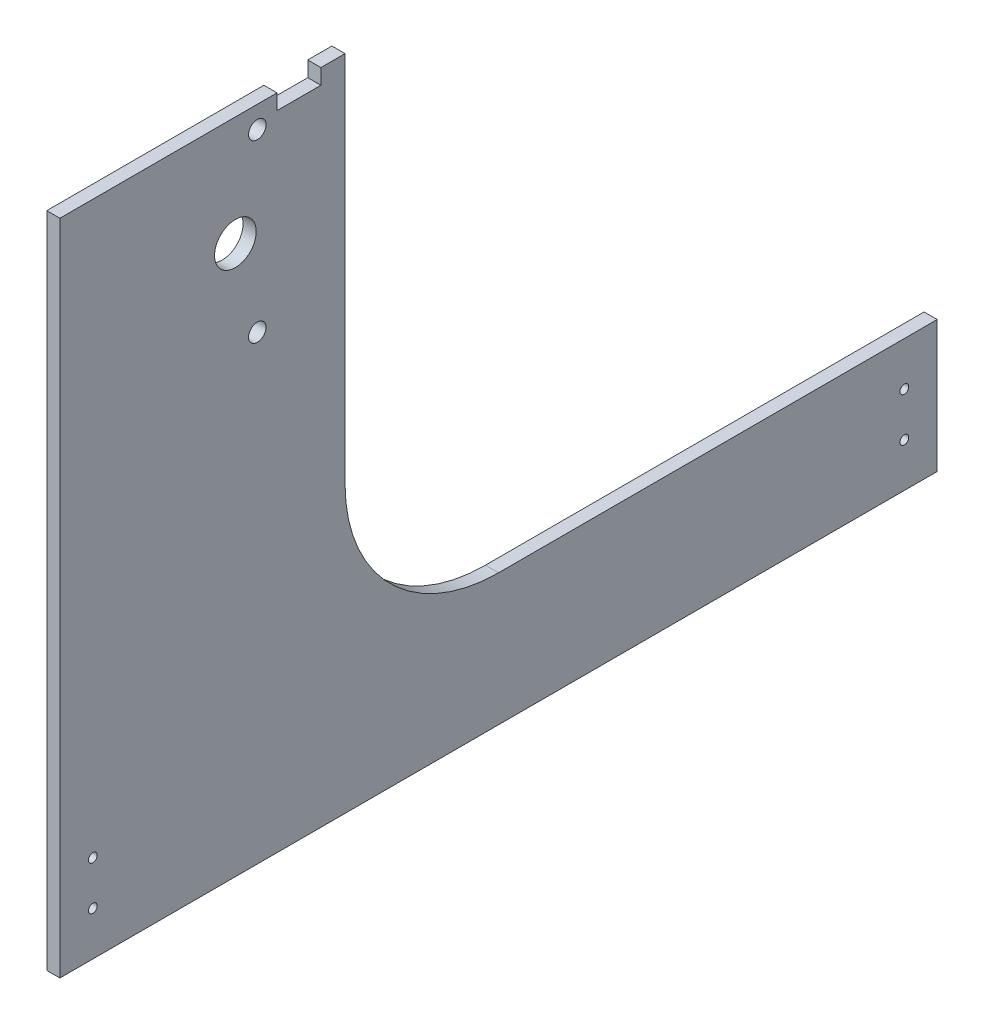
ISO-10303-21;
HEADER;
FILE_DESCRIPTION(('STEP AP214'),'2;1');
FILE_NAME('part.step','',(''),(''),'','','');
FILE_SCHEMA(('AUTOMOTIVE_DESIGN { 1 0 10303 214 1 1 1 1 }'));
ENDSEC;
DATA;
#1=APPLICATION_CONTEXT('core data for automotive mechanical design processes');
#2=APPLICATION_PROTOCOL_DEFINITION('international standard','automotive_design',2000,#1);
#3=PRODUCT_CONTEXT('',#1,'mechanical');
#4=PRODUCT('Part','Part','',(#3));
#5=PRODUCT_RELATED_PRODUCT_CATEGORY('part','',(#4));
#6=PRODUCT_DEFINITION_FORMATION('','',#4);
#7=PRODUCT_DEFINITION_CONTEXT('part definition',#1,'design');
#8=PRODUCT_DEFINITION('design','',#6,#7);
#9=PRODUCT_DEFINITION_SHAPE('','',#8);
#10=(LENGTH_UNIT() NAMED_UNIT(*) SI_UNIT(.MILLI.,.METRE.));
#11=(NAMED_UNIT(*) PLANE_ANGLE_UNIT() SI_UNIT($,.RADIAN.));
#12=(NAMED_UNIT(*) SI_UNIT($,.STERADIAN.) SOLID_ANGLE_UNIT());
#13=UNCERTAINTY_MEASURE_WITH_UNIT(LENGTH_MEASURE(1.E-05),#10,'distance_accuracy_value','');
#14=(GEOMETRIC_REPRESENTATION_CONTEXT(3) GLOBAL_UNCERTAINTY_ASSIGNED_CONTEXT((#13)) GLOBAL_UNIT_ASSIGNED_CONTEXT((#10,
#11,#12)) REPRESENTATION_CONTEXT('',''));
#15=CARTESIAN_POINT('',(0.,0.,0.));
#16=DIRECTION('',(0.,0.,1.));
#17=DIRECTION('',(1.,0.,0.));
#18=AXIS2_PLACEMENT_3D('',#15,#16,#17);
#19=CARTESIAN_POINT('',(6.,0.,80.));
#20=DIRECTION('',(0.,0.,-1.));
#21=DIRECTION('',(0.,1.,0.));
#22=AXIS2_PLACEMENT_3D('',#19,#20,#21);
#23=PLANE('',#22);
#24=DIRECTION('',(0.,-1.,0.));
#25=VECTOR('',#24,1.);
#26=CARTESIAN_POINT('',(0.,0.,80.));
#27=LINE('',#26,#25);
#28=CARTESIAN_POINT('',(0.,50.0000000000005,80.));
#29=VERTEX_POINT('',#28);
#30=CARTESIAN_POINT('',(0.,-250.,80.));
#31=VERTEX_POINT('',#30);
#32=EDGE_CURVE('E155',#29,#31,#27,.T.);
#33=ORIENTED_EDGE('',*,*,#32,.T.);
#34=DIRECTION('',(-1.,0.,0.));
#35=VECTOR('',#34,1.);
#36=CARTESIAN_POINT('',(6.,-250.,80.));
#37=LINE('',#36,#35);
#38=CARTESIAN_POINT('',(6.,-250.,80.));
#39=VERTEX_POINT('',#38);
#40=EDGE_CURVE('E11',#39,#31,#37,.T.);
#41=ORIENTED_EDGE('',*,*,#40,.F.);
#42=DIRECTION('',(0.,-1.,0.));
#43=VECTOR('',#42,1.);
#44=CARTESIAN_POINT('',(6.,0.,80.));
#45=LINE('',#44,#43);
#46=CARTESIAN_POINT('',(6.,50.0000000000005,80.));
#47=VERTEX_POINT('',#46);
#48=EDGE_CURVE('E98',#47,#39,#45,.T.);
#49=ORIENTED_EDGE('',*,*,#48,.F.);
#50=DIRECTION('',(-1.,0.,0.));
#51=VECTOR('',#50,1.);
#52=CARTESIAN_POINT('',(6.,50.0000000000005,80.));
#53=LINE('',#52,#51);
#54=EDGE_CURVE('E235',#47,#29,#53,.T.);
#55=ORIENTED_EDGE('',*,*,#54,.T.);
#56=EDGE_LOOP('',(#33,#41,#49,#55));
#57=FACE_BOUND('',#56,.T.);
#58=ADVANCED_FACE('F35',(#57),#23,.F.);
#59=CARTESIAN_POINT('',(6.,-250.,0.));
#60=DIRECTION('',(0.,1.,0.));
#61=DIRECTION('',(0.,0.,1.));
#62=AXIS2_PLACEMENT_3D('',#59,#60,#61);
#63=PLANE('',#62);
#64=DIRECTION('',(-1.,0.,0.));
#65=VECTOR('',#64,1.);
#66=CARTESIAN_POINT('',(6.,-250.,-320.));
#67=LINE('',#66,#65);
#68=CARTESIAN_POINT('',(6.,-250.,-320.));
#69=VERTEX_POINT('',#68);
#70=CARTESIAN_POINT('',(0.,-250.,-320.));
#71=VERTEX_POINT('',#70);
#72=EDGE_CURVE('E43',#69,#71,#67,.T.);
#73=ORIENTED_EDGE('',*,*,#72,.F.);
#74=DIRECTION('',(0.,0.,-1.));
#75=VECTOR('',#74,1.);
#76=CARTESIAN_POINT('',(6.,-250.,0.));
#77=LINE('',#76,#75);
#78=EDGE_CURVE('E221',#39,#69,#77,.T.);
#79=ORIENTED_EDGE('',*,*,#78,.F.);
#80=ORIENTED_EDGE('',*,*,#40,.T.);
#81=DIRECTION('',(0.,0.,-1.));
#82=VECTOR('',#81,1.);
#83=CARTESIAN_POINT('',(0.,-250.,0.));
#84=LINE('',#83,#82);
#85=EDGE_CURVE('E157',#31,#71,#84,.T.);
#86=ORIENTED_EDGE('',*,*,#85,.T.);
#87=EDGE_LOOP('',(#73,#79,#80,#86));
#88=FACE_BOUND('',#87,.T.);
#89=ADVANCED_FACE('F270',(#88),#63,.F.);
#90=CARTESIAN_POINT('',(6.,0.,-320.));
#91=DIRECTION('',(0.,0.,-1.));
#92=DIRECTION('',(-1.,0.,0.));
#93=AXIS2_PLACEMENT_3D('',#90,#91,#92);
#94=PLANE('',#93);
#95=DIRECTION('',(0.,-1.,0.));
#96=VECTOR('',#95,1.);
#97=CARTESIAN_POINT('',(0.,0.,-320.));
#98=LINE('',#97,#96);
#99=CARTESIAN_POINT('',(0.,-190.,-320.));
#100=VERTEX_POINT('',#99);
#101=EDGE_CURVE('E160',#100,#71,#98,.T.);
#102=ORIENTED_EDGE('',*,*,#101,.F.);
#103=DIRECTION('',(-1.,0.,0.));
#104=VECTOR('',#103,1.);
#105=CARTESIAN_POINT('',(6.,-190.,-320.));
#106=LINE('',#105,#104);
#107=CARTESIAN_POINT('',(6.,-190.,-320.));
#108=VERTEX_POINT('',#107);
#109=EDGE_CURVE('E197',#108,#100,#106,.T.);
#110=ORIENTED_EDGE('',*,*,#109,.F.);
#111=DIRECTION('',(0.,-1.,0.));
#112=VECTOR('',#111,1.);
#113=CARTESIAN_POINT('',(6.,0.,-320.));
#114=LINE('',#113,#112);
#115=EDGE_CURVE('E205',#108,#69,#114,.T.);
#116=ORIENTED_EDGE('',*,*,#115,.T.);
#117=ORIENTED_EDGE('',*,*,#72,.T.);
#118=EDGE_LOOP('',(#102,#110,#116,#117));
#119=FACE_BOUND('',#118,.T.);
#120=ADVANCED_FACE('F203',(#119),#94,.T.);
#121=CARTESIAN_POINT('',(6.,-190.,0.));
#122=DIRECTION('',(0.,1.,0.));
#123=DIRECTION('',(0.,0.,1.));
#124=AXIS2_PLACEMENT_3D('',#121,#122,#123);
#125=PLANE('',#124);
#126=DIRECTION('',(0.,0.,-1.));
#127=VECTOR('',#126,1.);
#128=CARTESIAN_POINT('',(0.,-190.,0.));
#129=LINE('',#128,#127);
#130=CARTESIAN_POINT('',(0.,-190.,-120.));
#131=VERTEX_POINT('',#130);
#132=EDGE_CURVE('E163',#131,#100,#129,.T.);
#133=ORIENTED_EDGE('',*,*,#132,.F.);
#134=DIRECTION('',(-1.,0.,0.));
#135=VECTOR('',#134,1.);
#136=CARTESIAN_POINT('',(6.,-190.,-120.));
#137=LINE('',#136,#135);
#138=CARTESIAN_POINT('',(6.,-190.,-120.));
#139=VERTEX_POINT('',#138);
#140=EDGE_CURVE('E195',#139,#131,#137,.T.);
#141=ORIENTED_EDGE('',*,*,#140,.F.);
#142=DIRECTION('',(0.,0.,-1.));
#143=VECTOR('',#142,1.);
#144=CARTESIAN_POINT('',(6.,-190.,0.));
#145=LINE('',#144,#143);
#146=EDGE_CURVE('E220',#139,#108,#145,.T.);
#147=ORIENTED_EDGE('',*,*,#146,.T.);
#148=ORIENTED_EDGE('',*,*,#109,.T.);
#149=EDGE_LOOP('',(#133,#141,#147,#148));
#150=FACE_BOUND('',#149,.T.);
#151=ADVANCED_FACE('F216',(#150),#125,.T.);
#152=CARTESIAN_POINT('',(6.,-120.,-120.));
#153=DIRECTION('',(-1.,0.,0.));
#154=DIRECTION('',(0.,0.,1.));
#155=AXIS2_PLACEMENT_3D('',#152,#153,#154);
#156=CYLINDRICAL_SURFACE('',#155,70.);
#157=CARTESIAN_POINT('',(0.,-120.,-120.));
#158=DIRECTION('',(1.,0.,0.));
#159=DIRECTION('',(0.,0.,-1.));
#160=AXIS2_PLACEMENT_3D('',#157,#158,#159);
#161=CIRCLE('',#160,70.);
#162=CARTESIAN_POINT('',(0.,-120.,-50.));
#163=VERTEX_POINT('',#162);
#164=EDGE_CURVE('E166',#131,#163,#161,.F.);
#165=ORIENTED_EDGE('',*,*,#164,.T.);
#166=DIRECTION('',(-1.,0.,0.));
#167=VECTOR('',#166,1.);
#168=CARTESIAN_POINT('',(6.,-120.,-50.));
#169=LINE('',#168,#167);
#170=CARTESIAN_POINT('',(6.,-120.,-50.));
#171=VERTEX_POINT('',#170);
#172=EDGE_CURVE('E193',#171,#163,#169,.T.);
#173=ORIENTED_EDGE('',*,*,#172,.F.);
#174=CARTESIAN_POINT('',(6.,-120.,-120.));
#175=DIRECTION('',(1.,0.,0.));
#176=DIRECTION('',(0.,0.,-1.));
#177=AXIS2_PLACEMENT_3D('',#174,#175,#176);
#178=CIRCLE('',#177,70.);
#179=EDGE_CURVE('E223',#139,#171,#178,.F.);
#180=ORIENTED_EDGE('',*,*,#179,.F.);
#181=ORIENTED_EDGE('',*,*,#140,.T.);
#182=EDGE_LOOP('',(#165,#173,#180,#181));
#183=FACE_BOUND('',#182,.T.);
#184=ADVANCED_FACE('F281',(#183),#156,.F.);
#185=CARTESIAN_POINT('',(6.,0.,-50.));
#186=DIRECTION('',(0.,0.,-1.));
#187=DIRECTION('',(0.,1.,0.));
#188=AXIS2_PLACEMENT_3D('',#185,#186,#187);
#189=PLANE('',#188);
#190=DIRECTION('',(0.,-1.,0.));
#191=VECTOR('',#190,1.);
#192=CARTESIAN_POINT('',(0.,0.,-50.));
#193=LINE('',#192,#191);
#194=CARTESIAN_POINT('',(0.,50.0000000000004,-50.));
#195=VERTEX_POINT('',#194);
#196=EDGE_CURVE('E169',#195,#163,#193,.T.);
#197=ORIENTED_EDGE('',*,*,#196,.F.);
#198=DIRECTION('',(-1.,0.,0.));
#199=VECTOR('',#198,1.);
#200=CARTESIAN_POINT('',(6.,50.0000000000004,-50.));
#201=LINE('',#200,#199);
#202=CARTESIAN_POINT('',(6.,50.0000000000004,-50.));
#203=VERTEX_POINT('',#202);
#204=EDGE_CURVE('E191',#203,#195,#201,.T.);
#205=ORIENTED_EDGE('',*,*,#204,.F.);
#206=DIRECTION('',(0.,-1.,0.));
#207=VECTOR('',#206,1.);
#208=CARTESIAN_POINT('',(6.,0.,-50.));
#209=LINE('',#208,#207);
#210=EDGE_CURVE('E229',#203,#171,#209,.T.);
#211=ORIENTED_EDGE('',*,*,#210,.T.);
#212=ORIENTED_EDGE('',*,*,#172,.T.);
#213=EDGE_LOOP('',(#197,#205,#211,#212));
#214=FACE_BOUND('',#213,.T.);
#215=ADVANCED_FACE('F284',(#214),#189,.T.);
#216=CARTESIAN_POINT('',(6.,50.0000000000005,0.));
#217=DIRECTION('',(0.,1.,0.));
#218=DIRECTION('',(0.,0.,1.));
#219=AXIS2_PLACEMENT_3D('',#216,#217,#218);
#220=PLANE('',#219);
#221=DIRECTION('',(0.,0.,-1.));
#222=VECTOR('',#221,1.);
#223=CARTESIAN_POINT('',(0.,50.0000000000005,0.));
#224=LINE('',#223,#222);
#225=CARTESIAN_POINT('',(0.,50.0000000000004,-39.0000000000001));
#226=VERTEX_POINT('',#225);
#227=EDGE_CURVE('E172',#226,#195,#224,.T.);
#228=ORIENTED_EDGE('',*,*,#227,.F.);
#229=DIRECTION('',(-1.,0.,0.));
#230=VECTOR('',#229,1.);
#231=CARTESIAN_POINT('',(6.,50.0000000000004,-39.0000000000001));
#232=LINE('',#231,#230);
#233=CARTESIAN_POINT('',(6.,50.0000000000004,-39.0000000000001));
#234=VERTEX_POINT('',#233);
#235=EDGE_CURVE('E140',#234,#226,#232,.T.);
#236=ORIENTED_EDGE('',*,*,#235,.F.);
#237=DIRECTION('',(0.,0.,-1.));
#238=VECTOR('',#237,1.);
#239=CARTESIAN_POINT('',(6.,50.0000000000005,0.));
#240=LINE('',#239,#238);
#241=EDGE_CURVE('E130',#234,#203,#240,.T.);
#242=ORIENTED_EDGE('',*,*,#241,.T.);
#243=ORIENTED_EDGE('',*,*,#204,.T.);
#244=EDGE_LOOP('',(#228,#236,#242,#243));
#245=FACE_BOUND('',#244,.T.);
#246=ADVANCED_FACE('F288',(#245),#220,.T.);
#247=CARTESIAN_POINT('',(6.,0.,-39.0000000000001));
#248=DIRECTION('',(0.,0.,-1.));
#249=DIRECTION('',(-1.,0.,0.));
#250=AXIS2_PLACEMENT_3D('',#247,#248,#249);
#251=PLANE('',#250);
#252=DIRECTION('',(0.,-1.,0.));
#253=VECTOR('',#252,1.);
#254=CARTESIAN_POINT('',(0.,0.,-39.0000000000001));
#255=LINE('',#254,#253);
#256=CARTESIAN_POINT('',(0.,43.0000000000004,-39.0000000000001));
#257=VERTEX_POINT('',#256);
#258=EDGE_CURVE('E137',#226,#257,#255,.T.);
#259=ORIENTED_EDGE('',*,*,#258,.T.);
#260=DIRECTION('',(-1.,0.,0.));
#261=VECTOR('',#260,1.);
#262=CARTESIAN_POINT('',(6.,43.0000000000004,-39.0000000000001));
#263=LINE('',#262,#261);
#264=CARTESIAN_POINT('',(6.,43.0000000000004,-39.0000000000001));
#265=VERTEX_POINT('',#264);
#266=EDGE_CURVE('E134',#265,#257,#263,.T.);
#267=ORIENTED_EDGE('',*,*,#266,.F.);
#268=DIRECTION('',(0.,-1.,0.));
#269=VECTOR('',#268,1.);
#270=CARTESIAN_POINT('',(6.,0.,-39.0000000000001));
#271=LINE('',#270,#269);
#272=EDGE_CURVE('E122',#234,#265,#271,.T.);
#273=ORIENTED_EDGE('',*,*,#272,.F.);
#274=ORIENTED_EDGE('',*,*,#235,.T.);
#275=EDGE_LOOP('',(#259,#267,#273,#274));
#276=FACE_BOUND('',#275,.T.);
#277=ADVANCED_FACE('F135',(#276),#251,.F.);
#278=CARTESIAN_POINT('',(6.,43.0000000000004,0.));
#279=DIRECTION('',(0.,-1.,0.));
#280=DIRECTION('',(0.,0.,-1.));
#281=AXIS2_PLACEMENT_3D('',#278,#279,#280);
#282=PLANE('',#281);
#283=DIRECTION('',(0.,0.,1.));
#284=VECTOR('',#283,1.);
#285=CARTESIAN_POINT('',(0.,43.0000000000004,0.));
#286=LINE('',#285,#284);
#287=CARTESIAN_POINT('',(0.,43.0000000000004,-19.0000000000001));
#288=VERTEX_POINT('',#287);
#289=EDGE_CURVE('E177',#257,#288,#286,.T.);
#290=ORIENTED_EDGE('',*,*,#289,.T.);
#291=DIRECTION('',(-1.,0.,0.));
#292=VECTOR('',#291,1.);
#293=CARTESIAN_POINT('',(6.,43.0000000000004,-19.0000000000001));
#294=LINE('',#293,#292);
#295=CARTESIAN_POINT('',(6.,43.0000000000004,-19.0000000000001));
#296=VERTEX_POINT('',#295);
#297=EDGE_CURVE('E85',#296,#288,#294,.T.);
#298=ORIENTED_EDGE('',*,*,#297,.F.);
#299=DIRECTION('',(0.,0.,1.));
#300=VECTOR('',#299,1.);
#301=CARTESIAN_POINT('',(6.,43.0000000000004,0.));
#302=LINE('',#301,#300);
#303=EDGE_CURVE('E127',#265,#296,#302,.T.);
#304=ORIENTED_EDGE('',*,*,#303,.F.);
#305=ORIENTED_EDGE('',*,*,#266,.T.);
#306=EDGE_LOOP('',(#290,#298,#304,#305));
#307=FACE_BOUND('',#306,.T.);
#308=ADVANCED_FACE('F142',(#307),#282,.F.);
#309=CARTESIAN_POINT('',(6.,0.,-19.0000000000001));
#310=DIRECTION('',(0.,0.,-1.));
#311=DIRECTION('',(-1.,0.,0.));
#312=AXIS2_PLACEMENT_3D('',#309,#310,#311);
#313=PLANE('',#312);
#314=DIRECTION('',(0.,-1.,0.));
#315=VECTOR('',#314,1.);
#316=CARTESIAN_POINT('',(0.,0.,-19.0000000000001));
#317=LINE('',#316,#315);
#318=CARTESIAN_POINT('',(0.,50.0000000000004,-19.0000000000001));
#319=VERTEX_POINT('',#318);
#320=EDGE_CURVE('E179',#319,#288,#317,.T.);
#321=ORIENTED_EDGE('',*,*,#320,.F.);
#322=DIRECTION('',(-1.,0.,0.));
#323=VECTOR('',#322,1.);
#324=CARTESIAN_POINT('',(6.,50.0000000000004,-19.0000000000001));
#325=LINE('',#324,#323);
#326=CARTESIAN_POINT('',(6.,50.0000000000004,-19.0000000000001));
#327=VERTEX_POINT('',#326);
#328=EDGE_CURVE('E51',#327,#319,#325,.T.);
#329=ORIENTED_EDGE('',*,*,#328,.F.);
#330=DIRECTION('',(0.,-1.,0.));
#331=VECTOR('',#330,1.);
#332=CARTESIAN_POINT('',(6.,0.,-19.0000000000001));
#333=LINE('',#332,#331);
#334=EDGE_CURVE('E143',#327,#296,#333,.T.);
#335=ORIENTED_EDGE('',*,*,#334,.T.);
#336=ORIENTED_EDGE('',*,*,#297,.T.);
#337=EDGE_LOOP('',(#321,#329,#335,#336));
#338=FACE_BOUND('',#337,.T.);
#339=ADVANCED_FACE('F294',(#338),#313,.T.);
#340=EDGE_CURVE('E175',#29,#319,#224,.T.);
#341=ORIENTED_EDGE('',*,*,#340,.F.);
#342=ORIENTED_EDGE('',*,*,#54,.F.);
#343=EDGE_CURVE('E145',#47,#327,#240,.T.);
#344=ORIENTED_EDGE('',*,*,#343,.T.);
#345=ORIENTED_EDGE('',*,*,#328,.T.);
#346=EDGE_LOOP('',(#341,#342,#344,#345));
#347=FACE_BOUND('',#346,.T.);
#348=ADVANCED_FACE('F233',(#347),#220,.T.);
#349=CARTESIAN_POINT('',(6.,-39.9999999999996,-10.0000000000001));
#350=DIRECTION('',(-1.,0.,0.));
#351=DIRECTION('',(0.,0.,1.));
#352=AXIS2_PLACEMENT_3D('',#349,#350,#351);
#353=CYLINDRICAL_SURFACE('',#352,4.);
#354=CARTESIAN_POINT('',(6.,-39.9999999999996,-10.0000000000001));
#355=DIRECTION('',(1.,0.,0.));
#356=DIRECTION('',(0.,0.,-1.));
#357=AXIS2_PLACEMENT_3D('',#354,#355,#356);
#358=CIRCLE('',#357,4.);
#359=CARTESIAN_POINT('',(6.,-39.9999999999996,-14.0000000000001));
#360=VERTEX_POINT('',#359);
#361=EDGE_CURVE('E152',#360,#360,#358,.T.);
#362=ORIENTED_EDGE('',*,*,#361,.T.);
#363=EDGE_LOOP('',(#362));
#364=FACE_BOUND('',#363,.T.);
#365=CARTESIAN_POINT('',(0.,-39.9999999999996,-10.0000000000001));
#366=DIRECTION('',(1.,0.,0.));
#367=DIRECTION('',(0.,0.,-1.));
#368=AXIS2_PLACEMENT_3D('',#365,#366,#367);
#369=CIRCLE('',#368,4.);
#370=CARTESIAN_POINT('',(0.,-39.9999999999996,-14.0000000000001));
#371=VERTEX_POINT('',#370);
#372=EDGE_CURVE('E185',#371,#371,#369,.T.);
#373=ORIENTED_EDGE('',*,*,#372,.F.);
#374=EDGE_LOOP('',(#373));
#375=FACE_BOUND('',#374,.T.);
#376=ADVANCED_FACE('F299',(#364,#375),#353,.F.);
#377=CARTESIAN_POINT('',(6.,40.0000000000004,-10.0000000000001));
#378=DIRECTION('',(-1.,0.,0.));
#379=DIRECTION('',(0.,0.,1.));
#380=AXIS2_PLACEMENT_3D('',#377,#378,#379);
#381=CYLINDRICAL_SURFACE('',#380,4.);
#382=CARTESIAN_POINT('',(6.,40.0000000000004,-10.0000000000001));
#383=DIRECTION('',(1.,0.,0.));
#384=DIRECTION('',(0.,0.,-1.));
#385=AXIS2_PLACEMENT_3D('',#382,#383,#384);
#386=CIRCLE('',#385,4.);
#387=CARTESIAN_POINT('',(6.,40.0000000000004,-14.0000000000001));
#388=VERTEX_POINT('',#387);
#389=EDGE_CURVE('E149',#388,#388,#386,.T.);
#390=ORIENTED_EDGE('',*,*,#389,.T.);
#391=EDGE_LOOP('',(#390));
#392=FACE_BOUND('',#391,.T.);
#393=CARTESIAN_POINT('',(0.,40.0000000000004,-10.0000000000001));
#394=DIRECTION('',(1.,0.,0.));
#395=DIRECTION('',(0.,0.,-1.));
#396=AXIS2_PLACEMENT_3D('',#393,#394,#395);
#397=CIRCLE('',#396,4.);
#398=CARTESIAN_POINT('',(0.,40.0000000000004,-14.0000000000001));
#399=VERTEX_POINT('',#398);
#400=EDGE_CURVE('E182',#399,#399,#397,.T.);
#401=ORIENTED_EDGE('',*,*,#400,.F.);
#402=EDGE_LOOP('',(#401));
#403=FACE_BOUND('',#402,.T.);
#404=ADVANCED_FACE('F263',(#392,#403),#381,.F.);
#405=CARTESIAN_POINT('',(6.,0.,0.));
#406=DIRECTION('',(1.,0.,0.));
#407=DIRECTION('',(0.,0.,-1.));
#408=AXIS2_PLACEMENT_3D('',#405,#406,#407);
#409=PLANE('',#408);
#410=CARTESIAN_POINT('',(6.,-209.99999999998,-305.));
#411=DIRECTION('',(1.,0.,0.));
#412=DIRECTION('',(0.,0.,-1.));
#413=AXIS2_PLACEMENT_3D('',#410,#411,#412);
#414=CIRCLE('',#413,2.);
#415=CARTESIAN_POINT('',(6.,-209.99999999998,-307.));
#416=VERTEX_POINT('',#415);
#417=EDGE_CURVE('E377',#416,#416,#414,.F.);
#418=ORIENTED_EDGE('',*,*,#417,.T.);
#419=EDGE_LOOP('',(#418));
#420=FACE_BOUND('',#419,.T.);
#421=CARTESIAN_POINT('',(6.,-230.000000000025,-305.));
#422=DIRECTION('',(1.,0.,0.));
#423=DIRECTION('',(0.,0.,-1.));
#424=AXIS2_PLACEMENT_3D('',#421,#422,#423);
#425=CIRCLE('',#424,2.);
#426=CARTESIAN_POINT('',(6.,-230.000000000025,-307.));
#427=VERTEX_POINT('',#426);
#428=EDGE_CURVE('E380',#427,#427,#425,.F.);
#429=ORIENTED_EDGE('',*,*,#428,.T.);
#430=EDGE_LOOP('',(#429));
#431=FACE_BOUND('',#430,.T.);
#432=CARTESIAN_POINT('',(6.,-230.000000000024,64.9999999999999));
#433=DIRECTION('',(1.,0.,0.));
#434=DIRECTION('',(0.,0.,-1.));
#435=AXIS2_PLACEMENT_3D('',#432,#433,#434);
#436=CIRCLE('',#435,2.);
#437=CARTESIAN_POINT('',(6.,-230.000000000024,62.9999999999999));
#438=VERTEX_POINT('',#437);
#439=EDGE_CURVE('E389',#438,#438,#436,.F.);
#440=ORIENTED_EDGE('',*,*,#439,.T.);
#441=EDGE_LOOP('',(#440));
#442=FACE_BOUND('',#441,.T.);
#443=CARTESIAN_POINT('',(6.,-209.999999999978,64.9999999999999));
#444=DIRECTION('',(1.,0.,0.));
#445=DIRECTION('',(0.,0.,-1.));
#446=AXIS2_PLACEMENT_3D('',#443,#444,#445);
#447=CIRCLE('',#446,2.);
#448=CARTESIAN_POINT('',(6.,-209.999999999978,62.9999999999999));
#449=VERTEX_POINT('',#448);
#450=EDGE_CURVE('E244',#449,#449,#447,.F.);
#451=ORIENTED_EDGE('',*,*,#450,.T.);
#452=EDGE_LOOP('',(#451));
#453=FACE_BOUND('',#452,.T.);
#454=ORIENTED_EDGE('',*,*,#343,.F.);
#455=ORIENTED_EDGE('',*,*,#48,.T.);
#456=ORIENTED_EDGE('',*,*,#78,.T.);
#457=ORIENTED_EDGE('',*,*,#115,.F.);
#458=ORIENTED_EDGE('',*,*,#146,.F.);
#459=ORIENTED_EDGE('',*,*,#179,.T.);
#460=ORIENTED_EDGE('',*,*,#210,.F.);
#461=ORIENTED_EDGE('',*,*,#241,.F.);
#462=ORIENTED_EDGE('',*,*,#272,.T.);
#463=ORIENTED_EDGE('',*,*,#303,.T.);
#464=ORIENTED_EDGE('',*,*,#334,.F.);
#465=EDGE_LOOP('',(#454,#455,#456,#457,#458,#459,#460,#461,#462,#463,#464));
#466=FACE_BOUND('',#465,.T.);
#467=CARTESIAN_POINT('',(6.,4.02455846426619E-13,0.));
#468=DIRECTION('',(1.,0.,0.));
#469=DIRECTION('',(0.,0.,-1.));
#470=AXIS2_PLACEMENT_3D('',#467,#468,#469);
#471=CIRCLE('',#470,9.5);
#472=CARTESIAN_POINT('',(6.,4.02455846426619E-13,-9.5));
#473=VERTEX_POINT('',#472);
#474=EDGE_CURVE('E238',#473,#473,#471,.T.);
#475=ORIENTED_EDGE('',*,*,#474,.F.);
#476=EDGE_LOOP('',(#475));
#477=FACE_BOUND('',#476,.T.);
#478=ORIENTED_EDGE('',*,*,#389,.F.);
#479=EDGE_LOOP('',(#478));
#480=FACE_BOUND('',#479,.T.);
#481=ORIENTED_EDGE('',*,*,#361,.F.);
#482=EDGE_LOOP('',(#481));
#483=FACE_BOUND('',#482,.T.);
#484=ADVANCED_FACE('F124',(#420,#431,#442,#453,#466,#477,#480,#483),#409,.T.);
#485=CARTESIAN_POINT('',(0.,0.,0.));
#486=DIRECTION('',(1.,0.,0.));
#487=DIRECTION('',(0.,0.,-1.));
#488=AXIS2_PLACEMENT_3D('',#485,#486,#487);
#489=PLANE('',#488);
#490=CARTESIAN_POINT('',(0.,-209.99999999998,-305.));
#491=DIRECTION('',(-1.,0.,0.));
#492=DIRECTION('',(0.,0.,-1.));
#493=AXIS2_PLACEMENT_3D('',#490,#491,#492);
#494=CIRCLE('',#493,2.);
#495=CARTESIAN_POINT('',(0.,-209.99999999998,-307.));
#496=VERTEX_POINT('',#495);
#497=EDGE_CURVE('E379',#496,#496,#494,.T.);
#498=ORIENTED_EDGE('',*,*,#497,.F.);
#499=EDGE_LOOP('',(#498));
#500=FACE_BOUND('',#499,.T.);
#501=CARTESIAN_POINT('',(0.,-230.000000000025,-305.));
#502=DIRECTION('',(-1.,0.,0.));
#503=DIRECTION('',(0.,0.,-1.));
#504=AXIS2_PLACEMENT_3D('',#501,#502,#503);
#505=CIRCLE('',#504,2.);
#506=CARTESIAN_POINT('',(0.,-230.000000000025,-307.));
#507=VERTEX_POINT('',#506);
#508=EDGE_CURVE('E383',#507,#507,#505,.T.);
#509=ORIENTED_EDGE('',*,*,#508,.F.);
#510=EDGE_LOOP('',(#509));
#511=FACE_BOUND('',#510,.T.);
#512=CARTESIAN_POINT('',(0.,-230.000000000024,64.9999999999999));
#513=DIRECTION('',(-1.,0.,0.));
#514=DIRECTION('',(0.,0.,1.));
#515=AXIS2_PLACEMENT_3D('',#512,#513,#514);
#516=CIRCLE('',#515,2.);
#517=CARTESIAN_POINT('',(0.,-230.000000000024,66.9999999999999));
#518=VERTEX_POINT('',#517);
#519=EDGE_CURVE('E392',#518,#518,#516,.T.);
#520=ORIENTED_EDGE('',*,*,#519,.F.);
#521=EDGE_LOOP('',(#520));
#522=FACE_BOUND('',#521,.T.);
#523=CARTESIAN_POINT('',(0.,-209.999999999978,64.9999999999999));
#524=DIRECTION('',(-1.,0.,0.));
#525=DIRECTION('',(0.,0.,1.));
#526=AXIS2_PLACEMENT_3D('',#523,#524,#525);
#527=CIRCLE('',#526,2.);
#528=CARTESIAN_POINT('',(0.,-209.999999999978,66.9999999999999));
#529=VERTEX_POINT('',#528);
#530=EDGE_CURVE('E239',#529,#529,#527,.T.);
#531=ORIENTED_EDGE('',*,*,#530,.F.);
#532=EDGE_LOOP('',(#531));
#533=FACE_BOUND('',#532,.T.);
#534=CARTESIAN_POINT('',(0.,4.02455846426619E-13,0.));
#535=DIRECTION('',(1.,0.,0.));
#536=DIRECTION('',(0.,0.,-1.));
#537=AXIS2_PLACEMENT_3D('',#534,#535,#536);
#538=CIRCLE('',#537,9.5);
#539=CARTESIAN_POINT('',(0.,4.02455846426619E-13,-9.5));
#540=VERTEX_POINT('',#539);
#541=EDGE_CURVE('E158',#540,#540,#538,.F.);
#542=ORIENTED_EDGE('',*,*,#541,.F.);
#543=EDGE_LOOP('',(#542));
#544=FACE_BOUND('',#543,.T.);
#545=ORIENTED_EDGE('',*,*,#101,.T.);
#546=ORIENTED_EDGE('',*,*,#85,.F.);
#547=ORIENTED_EDGE('',*,*,#32,.F.);
#548=ORIENTED_EDGE('',*,*,#340,.T.);
#549=ORIENTED_EDGE('',*,*,#320,.T.);
#550=ORIENTED_EDGE('',*,*,#289,.F.);
#551=ORIENTED_EDGE('',*,*,#258,.F.);
#552=ORIENTED_EDGE('',*,*,#227,.T.);
#553=ORIENTED_EDGE('',*,*,#196,.T.);
#554=ORIENTED_EDGE('',*,*,#164,.F.);
#555=ORIENTED_EDGE('',*,*,#132,.T.);
#556=EDGE_LOOP('',(#545,#546,#547,#548,#549,#550,#551,#552,#553,#554,#555));
#557=FACE_BOUND('',#556,.T.);
#558=ORIENTED_EDGE('',*,*,#400,.T.);
#559=EDGE_LOOP('',(#558));
#560=FACE_BOUND('',#559,.T.);
#561=ORIENTED_EDGE('',*,*,#372,.T.);
#562=EDGE_LOOP('',(#561));
#563=FACE_BOUND('',#562,.T.);
#564=ADVANCED_FACE('F210',(#500,#511,#522,#533,#544,#557,#560,#563),#489,.F.);
#565=CARTESIAN_POINT('',(-0.00100000000000013,4.02455846426619E-13,0.));
#566=DIRECTION('',(1.,0.,0.));
#567=DIRECTION('',(0.,0.,-1.));
#568=AXIS2_PLACEMENT_3D('',#565,#566,#567);
#569=CYLINDRICAL_SURFACE('',#568,9.5);
#570=ORIENTED_EDGE('',*,*,#474,.T.);
#571=EDGE_LOOP('',(#570));
#572=FACE_BOUND('',#571,.T.);
#573=ORIENTED_EDGE('',*,*,#541,.T.);
#574=EDGE_LOOP('',(#573));
#575=FACE_BOUND('',#574,.T.);
#576=ADVANCED_FACE('F251',(#572,#575),#569,.F.);
#577=CARTESIAN_POINT('',(6.001,-209.999999999978,64.9999999999999));
#578=DIRECTION('',(-1.,0.,0.));
#579=DIRECTION('',(0.,0.,1.));
#580=AXIS2_PLACEMENT_3D('',#577,#578,#579);
#581=CYLINDRICAL_SURFACE('',#580,2.);
#582=ORIENTED_EDGE('',*,*,#450,.F.);
#583=EDGE_LOOP('',(#582));
#584=FACE_BOUND('',#583,.T.);
#585=ORIENTED_EDGE('',*,*,#530,.T.);
#586=EDGE_LOOP('',(#585));
#587=FACE_BOUND('',#586,.T.);
#588=ADVANCED_FACE('F260',(#584,#587),#581,.F.);
#589=CARTESIAN_POINT('',(6.001,-230.000000000024,64.9999999999999));
#590=DIRECTION('',(-1.,0.,0.));
#591=DIRECTION('',(0.,0.,1.));
#592=AXIS2_PLACEMENT_3D('',#589,#590,#591);
#593=CYLINDRICAL_SURFACE('',#592,2.);
#594=ORIENTED_EDGE('',*,*,#439,.F.);
#595=EDGE_LOOP('',(#594));
#596=FACE_BOUND('',#595,.T.);
#597=ORIENTED_EDGE('',*,*,#519,.T.);
#598=EDGE_LOOP('',(#597));
#599=FACE_BOUND('',#598,.T.);
#600=ADVANCED_FACE('F340',(#596,#599),#593,.F.);
#601=CARTESIAN_POINT('',(6.001,-230.000000000025,-305.));
#602=DIRECTION('',(-1.,0.,0.));
#603=DIRECTION('',(0.,0.,1.));
#604=AXIS2_PLACEMENT_3D('',#601,#602,#603);
#605=CYLINDRICAL_SURFACE('',#604,2.);
#606=ORIENTED_EDGE('',*,*,#428,.F.);
#607=EDGE_LOOP('',(#606));
#608=FACE_BOUND('',#607,.T.);
#609=ORIENTED_EDGE('',*,*,#508,.T.);
#610=EDGE_LOOP('',(#609));
#611=FACE_BOUND('',#610,.T.);
#612=ADVANCED_FACE('F350',(#608,#611),#605,.F.);
#613=CARTESIAN_POINT('',(6.001,-209.99999999998,-305.));
#614=DIRECTION('',(-1.,0.,0.));
#615=DIRECTION('',(0.,0.,1.));
#616=AXIS2_PLACEMENT_3D('',#613,#614,#615);
#617=CYLINDRICAL_SURFACE('',#616,2.);
#618=ORIENTED_EDGE('',*,*,#417,.F.);
#619=EDGE_LOOP('',(#618));
#620=FACE_BOUND('',#619,.T.);
#621=ORIENTED_EDGE('',*,*,#497,.T.);
#622=EDGE_LOOP('',(#621));
#623=FACE_BOUND('',#622,.T.);
#624=ADVANCED_FACE('F360',(#620,#623),#617,.F.);
#625=CLOSED_SHELL('',(#58,#89,#120,#151,#184,#215,#246,#277,#308,#339,#348,#376,#404,#484,#564,
#576,#588,#600,#612,#624));
#626=MANIFOLD_SOLID_BREP('B2',#625);
#627=ADVANCED_BREP_SHAPE_REPRESENTATION('',(#18,#626),#14);
#628=SHAPE_DEFINITION_REPRESENTATION(#9,#627);
ENDSEC;
END-ISO-10303-21;
